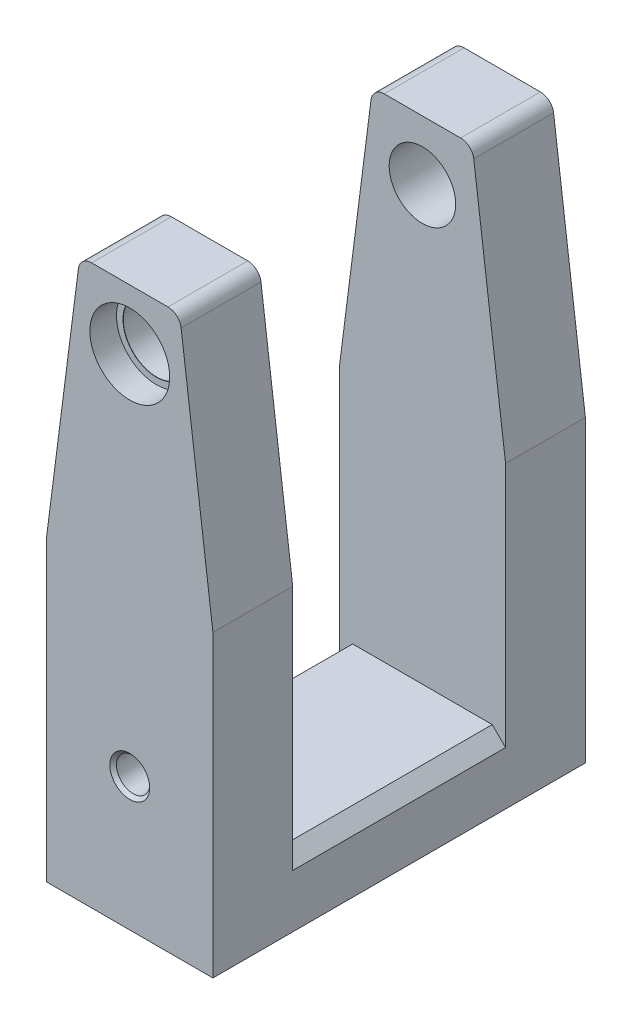
ISO-10303-21;
HEADER;
FILE_DESCRIPTION(('STEP AP214'),'2;1');
FILE_NAME('part.step','',(''),(''),'','','');
FILE_SCHEMA(('AUTOMOTIVE_DESIGN { 1 0 10303 214 1 1 1 1 }'));
ENDSEC;
DATA;
#1=APPLICATION_CONTEXT('core data for automotive mechanical design processes');
#2=APPLICATION_PROTOCOL_DEFINITION('international standard','automotive_design',2000,#1);
#3=PRODUCT_CONTEXT('',#1,'mechanical');
#4=PRODUCT('Part','Part','',(#3));
#5=PRODUCT_RELATED_PRODUCT_CATEGORY('part','',(#4));
#6=PRODUCT_DEFINITION_FORMATION('','',#4);
#7=PRODUCT_DEFINITION_CONTEXT('part definition',#1,'design');
#8=PRODUCT_DEFINITION('design','',#6,#7);
#9=PRODUCT_DEFINITION_SHAPE('','',#8);
#10=(LENGTH_UNIT() NAMED_UNIT(*) SI_UNIT(.MILLI.,.METRE.));
#11=(NAMED_UNIT(*) PLANE_ANGLE_UNIT() SI_UNIT($,.RADIAN.));
#12=(NAMED_UNIT(*) SI_UNIT($,.STERADIAN.) SOLID_ANGLE_UNIT());
#13=UNCERTAINTY_MEASURE_WITH_UNIT(LENGTH_MEASURE(1.E-05),#10,'distance_accuracy_value','');
#14=(GEOMETRIC_REPRESENTATION_CONTEXT(3) GLOBAL_UNCERTAINTY_ASSIGNED_CONTEXT((#13)) GLOBAL_UNIT_ASSIGNED_CONTEXT((#10,
#11,#12)) REPRESENTATION_CONTEXT('',''));
#15=CARTESIAN_POINT('',(0.,0.,0.));
#16=DIRECTION('',(0.,0.,1.));
#17=DIRECTION('',(1.,0.,0.));
#18=AXIS2_PLACEMENT_3D('',#15,#16,#17);
#19=CARTESIAN_POINT('',(7.5,84.,28.));
#20=DIRECTION('',(-0.991881664685851,-0.127164315985366,0.));
#21=DIRECTION('',(0.127164315985366,-0.991881664685851,0.));
#22=AXIS2_PLACEMENT_3D('',#19,#20,#21);
#23=PLANE('',#22);
#24=DIRECTION('',(-0.127164315985366,0.991881664685851,0.));
#25=VECTOR('',#24,1.);
#26=CARTESIAN_POINT('',(7.5,84.,16.));
#27=LINE('',#26,#25);
#28=CARTESIAN_POINT('',(12.5,45.,16.));
#29=VERTEX_POINT('',#28);
#30=CARTESIAN_POINT('',(7.72380402154221,82.2543286319707,16.));
#31=VERTEX_POINT('',#30);
#32=EDGE_CURVE('E345',#29,#31,#27,.T.);
#33=ORIENTED_EDGE('',*,*,#32,.T.);
#34=DIRECTION('',(0.,0.,-1.));
#35=VECTOR('',#34,1.);
#36=CARTESIAN_POINT('',(7.72380402154221,82.2543286319707,28.));
#37=LINE('',#36,#35);
#38=CARTESIAN_POINT('',(7.72380402154221,82.2543286319707,28.));
#39=VERTEX_POINT('',#38);
#40=EDGE_CURVE('E50',#31,#39,#37,.F.);
#41=ORIENTED_EDGE('',*,*,#40,.T.);
#42=DIRECTION('',(-0.127164315985366,0.99188166468585,0.));
#43=VECTOR('',#42,1.);
#44=CARTESIAN_POINT('',(7.5,84.,28.));
#45=LINE('',#44,#43);
#46=CARTESIAN_POINT('',(12.5,45.,28.));
#47=VERTEX_POINT('',#46);
#48=EDGE_CURVE('E352',#47,#39,#45,.T.);
#49=ORIENTED_EDGE('',*,*,#48,.F.);
#50=DIRECTION('',(0.,0.,-1.));
#51=VECTOR('',#50,1.);
#52=CARTESIAN_POINT('',(12.5,45.,28.));
#53=LINE('',#52,#51);
#54=EDGE_CURVE('E201',#47,#29,#53,.T.);
#55=ORIENTED_EDGE('',*,*,#54,.T.);
#56=EDGE_LOOP('',(#33,#41,#49,#55));
#57=FACE_BOUND('',#56,.T.);
#58=ADVANCED_FACE('F41',(#57),#23,.F.);
#59=CARTESIAN_POINT('',(-7.5,84.,28.));
#60=DIRECTION('',(0.,-1.,0.));
#61=DIRECTION('',(0.,0.,-1.));
#62=AXIS2_PLACEMENT_3D('',#59,#60,#61);
#63=PLANE('',#62);
#64=DIRECTION('',(1.,0.,0.));
#65=VECTOR('',#64,1.);
#66=CARTESIAN_POINT('',(-12.5,84.,16.));
#67=LINE('',#66,#65);
#68=CARTESIAN_POINT('',(-5.74004069217051,84.,16.));
#69=VERTEX_POINT('',#68);
#70=CARTESIAN_POINT('',(5.74004069217051,84.,16.));
#71=VERTEX_POINT('',#70);
#72=EDGE_CURVE('E321',#69,#71,#67,.T.);
#73=ORIENTED_EDGE('',*,*,#72,.F.);
#74=DIRECTION('',(0.,0.,-1.));
#75=VECTOR('',#74,1.);
#76=CARTESIAN_POINT('',(-5.74004069217051,84.,28.));
#77=LINE('',#76,#75);
#78=CARTESIAN_POINT('',(-5.74004069217051,84.,28.));
#79=VERTEX_POINT('',#78);
#80=EDGE_CURVE('E64',#69,#79,#77,.F.);
#81=ORIENTED_EDGE('',*,*,#80,.T.);
#82=DIRECTION('',(-1.,0.,0.));
#83=VECTOR('',#82,1.);
#84=CARTESIAN_POINT('',(-7.5,84.,28.));
#85=LINE('',#84,#83);
#86=CARTESIAN_POINT('',(5.74004069217051,84.,28.));
#87=VERTEX_POINT('',#86);
#88=EDGE_CURVE('E307',#87,#79,#85,.T.);
#89=ORIENTED_EDGE('',*,*,#88,.F.);
#90=DIRECTION('',(0.,0.,-1.));
#91=VECTOR('',#90,1.);
#92=CARTESIAN_POINT('',(5.74004069217051,84.,28.));
#93=LINE('',#92,#91);
#94=EDGE_CURVE('E289',#87,#71,#93,.T.);
#95=ORIENTED_EDGE('',*,*,#94,.T.);
#96=EDGE_LOOP('',(#73,#81,#89,#95));
#97=FACE_BOUND('',#96,.T.);
#98=ADVANCED_FACE('F323',(#97),#63,.F.);
#99=CARTESIAN_POINT('',(-12.5,45.,28.));
#100=DIRECTION('',(0.991881664685851,-0.127164315985366,0.));
#101=DIRECTION('',(0.127164315985366,0.991881664685851,0.));
#102=AXIS2_PLACEMENT_3D('',#99,#100,#101);
#103=PLANE('',#102);
#104=DIRECTION('',(-0.127164315985366,-0.99188166468585,0.));
#105=VECTOR('',#104,1.);
#106=CARTESIAN_POINT('',(-12.5,45.,28.));
#107=LINE('',#106,#105);
#108=CARTESIAN_POINT('',(-7.72380402154221,82.2543286319707,28.));
#109=VERTEX_POINT('',#108);
#110=CARTESIAN_POINT('',(-12.5,45.,28.));
#111=VERTEX_POINT('',#110);
#112=EDGE_CURVE('E305',#109,#111,#107,.T.);
#113=ORIENTED_EDGE('',*,*,#112,.F.);
#114=DIRECTION('',(0.,0.,-1.));
#115=VECTOR('',#114,1.);
#116=CARTESIAN_POINT('',(-7.72380402154221,82.2543286319707,28.));
#117=LINE('',#116,#115);
#118=CARTESIAN_POINT('',(-7.72380402154221,82.2543286319707,16.));
#119=VERTEX_POINT('',#118);
#120=EDGE_CURVE('E279',#109,#119,#117,.T.);
#121=ORIENTED_EDGE('',*,*,#120,.T.);
#122=DIRECTION('',(-0.127164315985366,-0.991881664685851,0.));
#123=VECTOR('',#122,1.);
#124=CARTESIAN_POINT('',(-12.5,45.,16.));
#125=LINE('',#124,#123);
#126=CARTESIAN_POINT('',(-12.5,45.,16.));
#127=VERTEX_POINT('',#126);
#128=EDGE_CURVE('E180',#119,#127,#125,.T.);
#129=ORIENTED_EDGE('',*,*,#128,.T.);
#130=DIRECTION('',(0.,0.,-1.));
#131=VECTOR('',#130,1.);
#132=CARTESIAN_POINT('',(-12.5,45.,28.));
#133=LINE('',#132,#131);
#134=EDGE_CURVE('E202',#111,#127,#133,.T.);
#135=ORIENTED_EDGE('',*,*,#134,.F.);
#136=EDGE_LOOP('',(#113,#121,#129,#135));
#137=FACE_BOUND('',#136,.T.);
#138=ADVANCED_FACE('F311',(#137),#103,.F.);
#139=CARTESIAN_POINT('',(12.5,45.,28.));
#140=DIRECTION('',(-1.,0.,0.));
#141=DIRECTION('',(0.,0.,1.));
#142=AXIS2_PLACEMENT_3D('',#139,#140,#141);
#143=PLANE('',#142);
#144=DIRECTION('',(0.,1.,0.));
#145=VECTOR('',#144,1.);
#146=CARTESIAN_POINT('',(12.5,84.,-16.));
#147=LINE('',#146,#145);
#148=CARTESIAN_POINT('',(12.5,8.,-16.));
#149=VERTEX_POINT('',#148);
#150=CARTESIAN_POINT('',(12.5,45.,-16.));
#151=VERTEX_POINT('',#150);
#152=EDGE_CURVE('E184',#149,#151,#147,.T.);
#153=ORIENTED_EDGE('',*,*,#152,.F.);
#154=DIRECTION('',(0.,0.,1.));
#155=VECTOR('',#154,1.);
#156=CARTESIAN_POINT('',(12.5,7.99999999999999,28.));
#157=LINE('',#156,#155);
#158=CARTESIAN_POINT('',(12.5,7.99999999999999,16.));
#159=VERTEX_POINT('',#158);
#160=EDGE_CURVE('E243',#149,#159,#157,.T.);
#161=ORIENTED_EDGE('',*,*,#160,.T.);
#162=DIRECTION('',(0.,-1.,0.));
#163=VECTOR('',#162,1.);
#164=CARTESIAN_POINT('',(12.5,84.,16.));
#165=LINE('',#164,#163);
#166=EDGE_CURVE('E193',#29,#159,#165,.T.);
#167=ORIENTED_EDGE('',*,*,#166,.F.);
#168=ORIENTED_EDGE('',*,*,#54,.F.);
#169=DIRECTION('',(0.,1.,0.));
#170=VECTOR('',#169,1.);
#171=CARTESIAN_POINT('',(12.5,45.,28.));
#172=LINE('',#171,#170);
#173=CARTESIAN_POINT('',(12.5,0.,28.));
#174=VERTEX_POINT('',#173);
#175=EDGE_CURVE('E348',#174,#47,#172,.T.);
#176=ORIENTED_EDGE('',*,*,#175,.F.);
#177=DIRECTION('',(0.,0.,-1.));
#178=VECTOR('',#177,1.);
#179=CARTESIAN_POINT('',(12.5,0.,28.));
#180=LINE('',#179,#178);
#181=CARTESIAN_POINT('',(12.5,0.,-28.));
#182=VERTEX_POINT('',#181);
#183=EDGE_CURVE('E363',#174,#182,#180,.T.);
#184=ORIENTED_EDGE('',*,*,#183,.T.);
#185=DIRECTION('',(0.,1.,0.));
#186=VECTOR('',#185,1.);
#187=CARTESIAN_POINT('',(12.5,45.,-28.));
#188=LINE('',#187,#186);
#189=CARTESIAN_POINT('',(12.5,45.,-28.));
#190=VERTEX_POINT('',#189);
#191=EDGE_CURVE('E199',#182,#190,#188,.T.);
#192=ORIENTED_EDGE('',*,*,#191,.T.);
#193=EDGE_CURVE('E173',#151,#190,#53,.T.);
#194=ORIENTED_EDGE('',*,*,#193,.F.);
#195=EDGE_LOOP('',(#153,#161,#167,#168,#176,#184,#192,#194));
#196=FACE_BOUND('',#195,.T.);
#197=ADVANCED_FACE('F196',(#196),#143,.F.);
#198=DIRECTION('',(-0.127164315985366,0.99188166468585,0.));
#199=VECTOR('',#198,1.);
#200=CARTESIAN_POINT('',(7.5,84.,-28.));
#201=LINE('',#200,#199);
#202=CARTESIAN_POINT('',(7.72380402154221,82.2543286319707,-28.));
#203=VERTEX_POINT('',#202);
#204=EDGE_CURVE('E366',#190,#203,#201,.T.);
#205=ORIENTED_EDGE('',*,*,#204,.T.);
#206=DIRECTION('',(0.,0.,-1.));
#207=VECTOR('',#206,1.);
#208=CARTESIAN_POINT('',(7.72380402154221,82.2543286319707,28.));
#209=LINE('',#208,#207);
#210=CARTESIAN_POINT('',(7.72380402154221,82.2543286319707,-16.));
#211=VERTEX_POINT('',#210);
#212=EDGE_CURVE('E176',#203,#211,#209,.F.);
#213=ORIENTED_EDGE('',*,*,#212,.T.);
#214=DIRECTION('',(0.127164315985366,-0.991881664685851,0.));
#215=VECTOR('',#214,1.);
#216=CARTESIAN_POINT('',(7.5,84.,-16.));
#217=LINE('',#216,#215);
#218=EDGE_CURVE('E168',#211,#151,#217,.T.);
#219=ORIENTED_EDGE('',*,*,#218,.T.);
#220=ORIENTED_EDGE('',*,*,#193,.T.);
#221=EDGE_LOOP('',(#205,#213,#219,#220));
#222=FACE_BOUND('',#221,.T.);
#223=ADVANCED_FACE('F171',(#222),#23,.F.);
#224=DIRECTION('',(1.,0.,0.));
#225=VECTOR('',#224,1.);
#226=CARTESIAN_POINT('',(-12.5,84.,-16.));
#227=LINE('',#226,#225);
#228=CARTESIAN_POINT('',(-5.74004069217051,84.,-16.));
#229=VERTEX_POINT('',#228);
#230=CARTESIAN_POINT('',(5.74004069217051,84.,-16.));
#231=VERTEX_POINT('',#230);
#232=EDGE_CURVE('E326',#229,#231,#227,.T.);
#233=ORIENTED_EDGE('',*,*,#232,.T.);
#234=DIRECTION('',(0.,0.,-1.));
#235=VECTOR('',#234,1.);
#236=CARTESIAN_POINT('',(5.74004069217051,84.,28.));
#237=LINE('',#236,#235);
#238=CARTESIAN_POINT('',(5.74004069217051,84.,-28.));
#239=VERTEX_POINT('',#238);
#240=EDGE_CURVE('E261',#231,#239,#237,.T.);
#241=ORIENTED_EDGE('',*,*,#240,.T.);
#242=DIRECTION('',(-1.,0.,0.));
#243=VECTOR('',#242,1.);
#244=CARTESIAN_POINT('',(-7.5,84.,-28.));
#245=LINE('',#244,#243);
#246=CARTESIAN_POINT('',(-5.74004069217051,84.,-28.));
#247=VERTEX_POINT('',#246);
#248=EDGE_CURVE('E369',#239,#247,#245,.T.);
#249=ORIENTED_EDGE('',*,*,#248,.T.);
#250=DIRECTION('',(0.,0.,-1.));
#251=VECTOR('',#250,1.);
#252=CARTESIAN_POINT('',(-5.74004069217051,84.,28.));
#253=LINE('',#252,#251);
#254=EDGE_CURVE('E258',#247,#229,#253,.F.);
#255=ORIENTED_EDGE('',*,*,#254,.T.);
#256=EDGE_LOOP('',(#233,#241,#249,#255));
#257=FACE_BOUND('',#256,.T.);
#258=ADVANCED_FACE('F438',(#257),#63,.F.);
#259=DIRECTION('',(0.127164315985366,0.991881664685851,0.));
#260=VECTOR('',#259,1.);
#261=CARTESIAN_POINT('',(-12.5,45.,-16.));
#262=LINE('',#261,#260);
#263=CARTESIAN_POINT('',(-12.5,45.,-16.));
#264=VERTEX_POINT('',#263);
#265=CARTESIAN_POINT('',(-7.72380402154221,82.2543286319707,-16.));
#266=VERTEX_POINT('',#265);
#267=EDGE_CURVE('E181',#264,#266,#262,.T.);
#268=ORIENTED_EDGE('',*,*,#267,.T.);
#269=DIRECTION('',(0.,0.,-1.));
#270=VECTOR('',#269,1.);
#271=CARTESIAN_POINT('',(-7.72380402154221,82.2543286319707,28.));
#272=LINE('',#271,#270);
#273=CARTESIAN_POINT('',(-7.72380402154221,82.2543286319707,-28.));
#274=VERTEX_POINT('',#273);
#275=EDGE_CURVE('E11',#266,#274,#272,.T.);
#276=ORIENTED_EDGE('',*,*,#275,.T.);
#277=DIRECTION('',(-0.127164315985366,-0.99188166468585,0.));
#278=VECTOR('',#277,1.);
#279=CARTESIAN_POINT('',(-12.5,45.,-28.));
#280=LINE('',#279,#278);
#281=CARTESIAN_POINT('',(-12.5,45.,-28.));
#282=VERTEX_POINT('',#281);
#283=EDGE_CURVE('E373',#274,#282,#280,.T.);
#284=ORIENTED_EDGE('',*,*,#283,.T.);
#285=EDGE_CURVE('E209',#264,#282,#133,.T.);
#286=ORIENTED_EDGE('',*,*,#285,.F.);
#287=EDGE_LOOP('',(#268,#276,#284,#286));
#288=FACE_BOUND('',#287,.T.);
#289=ADVANCED_FACE('F445',(#288),#103,.F.);
#290=CARTESIAN_POINT('',(-12.5,0.,28.));
#291=DIRECTION('',(1.,0.,0.));
#292=DIRECTION('',(0.,0.,-1.));
#293=AXIS2_PLACEMENT_3D('',#290,#291,#292);
#294=PLANE('',#293);
#295=DIRECTION('',(0.,0.,-1.));
#296=VECTOR('',#295,1.);
#297=CARTESIAN_POINT('',(-12.5,8.00000000000001,28.));
#298=LINE('',#297,#296);
#299=CARTESIAN_POINT('',(-12.5,8.00000000000001,16.));
#300=VERTEX_POINT('',#299);
#301=CARTESIAN_POINT('',(-12.5,8.00000000000001,-16.));
#302=VERTEX_POINT('',#301);
#303=EDGE_CURVE('E215',#300,#302,#298,.T.);
#304=ORIENTED_EDGE('',*,*,#303,.T.);
#305=DIRECTION('',(0.,1.,0.));
#306=VECTOR('',#305,1.);
#307=CARTESIAN_POINT('',(-12.5,84.,-16.));
#308=LINE('',#307,#306);
#309=EDGE_CURVE('E192',#302,#264,#308,.T.);
#310=ORIENTED_EDGE('',*,*,#309,.T.);
#311=ORIENTED_EDGE('',*,*,#285,.T.);
#312=DIRECTION('',(0.,-1.,0.));
#313=VECTOR('',#312,1.);
#314=CARTESIAN_POINT('',(-12.5,0.,-28.));
#315=LINE('',#314,#313);
#316=CARTESIAN_POINT('',(-12.5,0.,-28.));
#317=VERTEX_POINT('',#316);
#318=EDGE_CURVE('E376',#282,#317,#315,.T.);
#319=ORIENTED_EDGE('',*,*,#318,.T.);
#320=DIRECTION('',(0.,0.,-1.));
#321=VECTOR('',#320,1.);
#322=CARTESIAN_POINT('',(-12.5,0.,28.));
#323=LINE('',#322,#321);
#324=CARTESIAN_POINT('',(-12.5,0.,28.));
#325=VERTEX_POINT('',#324);
#326=EDGE_CURVE('E382',#325,#317,#323,.T.);
#327=ORIENTED_EDGE('',*,*,#326,.F.);
#328=DIRECTION('',(0.,-1.,0.));
#329=VECTOR('',#328,1.);
#330=CARTESIAN_POINT('',(-12.5,0.,28.));
#331=LINE('',#330,#329);
#332=EDGE_CURVE('E315',#111,#325,#331,.T.);
#333=ORIENTED_EDGE('',*,*,#332,.F.);
#334=ORIENTED_EDGE('',*,*,#134,.T.);
#335=DIRECTION('',(0.,-1.,0.));
#336=VECTOR('',#335,1.);
#337=CARTESIAN_POINT('',(-12.5,0.,16.));
#338=LINE('',#337,#336);
#339=EDGE_CURVE('E207',#127,#300,#338,.T.);
#340=ORIENTED_EDGE('',*,*,#339,.T.);
#341=EDGE_LOOP('',(#304,#310,#311,#319,#327,#333,#334,#340));
#342=FACE_BOUND('',#341,.T.);
#343=ADVANCED_FACE('F395',(#342),#294,.F.);
#344=CARTESIAN_POINT('',(12.5,0.,28.));
#345=DIRECTION('',(0.,1.,0.));
#346=DIRECTION('',(0.,0.,1.));
#347=AXIS2_PLACEMENT_3D('',#344,#345,#346);
#348=PLANE('',#347);
#349=DIRECTION('',(1.,0.,0.));
#350=VECTOR('',#349,1.);
#351=CARTESIAN_POINT('',(12.5,0.,-28.));
#352=LINE('',#351,#350);
#353=EDGE_CURVE('E353',#317,#182,#352,.T.);
#354=ORIENTED_EDGE('',*,*,#353,.T.);
#355=ORIENTED_EDGE('',*,*,#183,.F.);
#356=DIRECTION('',(1.,0.,0.));
#357=VECTOR('',#356,1.);
#358=CARTESIAN_POINT('',(12.5,0.,28.));
#359=LINE('',#358,#357);
#360=EDGE_CURVE('E360',#325,#174,#359,.T.);
#361=ORIENTED_EDGE('',*,*,#360,.F.);
#362=ORIENTED_EDGE('',*,*,#326,.T.);
#363=EDGE_LOOP('',(#354,#355,#361,#362));
#364=FACE_BOUND('',#363,.T.);
#365=ADVANCED_FACE('F402',(#364),#348,.F.);
#366=CARTESIAN_POINT('',(0.,0.,28.));
#367=DIRECTION('',(0.,0.,-1.));
#368=DIRECTION('',(-1.,0.,0.));
#369=AXIS2_PLACEMENT_3D('',#366,#367,#368);
#370=PLANE('',#369);
#371=CARTESIAN_POINT('',(0.,20.,28.));
#372=DIRECTION('',(0.,0.,1.));
#373=DIRECTION('',(1.,0.,0.));
#374=AXIS2_PLACEMENT_3D('',#371,#372,#373);
#375=CIRCLE('',#374,3.);
#376=CARTESIAN_POINT('',(3.,20.,28.));
#377=VERTEX_POINT('',#376);
#378=EDGE_CURVE('E533',#377,#377,#375,.T.);
#379=ORIENTED_EDGE('',*,*,#378,.F.);
#380=EDGE_LOOP('',(#379));
#381=FACE_BOUND('',#380,.T.);
#382=CARTESIAN_POINT('',(0.,75.,28.));
#383=DIRECTION('',(0.,0.,1.));
#384=DIRECTION('',(1.,0.,0.));
#385=AXIS2_PLACEMENT_3D('',#382,#383,#384);
#386=CIRCLE('',#385,5.99999999999999);
#387=CARTESIAN_POINT('',(6.,75.,28.));
#388=VERTEX_POINT('',#387);
#389=EDGE_CURVE('E225',#388,#388,#386,.T.);
#390=ORIENTED_EDGE('',*,*,#389,.F.);
#391=EDGE_LOOP('',(#390));
#392=FACE_BOUND('',#391,.T.);
#393=ORIENTED_EDGE('',*,*,#88,.T.);
#394=CARTESIAN_POINT('',(-5.74004069217051,82.,28.));
#395=DIRECTION('',(0.,0.,-1.));
#396=DIRECTION('',(-1.,0.,0.));
#397=AXIS2_PLACEMENT_3D('',#394,#395,#396);
#398=CIRCLE('',#397,2.);
#399=EDGE_CURVE('E298',#79,#109,#398,.F.);
#400=ORIENTED_EDGE('',*,*,#399,.T.);
#401=ORIENTED_EDGE('',*,*,#112,.T.);
#402=ORIENTED_EDGE('',*,*,#332,.T.);
#403=ORIENTED_EDGE('',*,*,#360,.T.);
#404=ORIENTED_EDGE('',*,*,#175,.T.);
#405=ORIENTED_EDGE('',*,*,#48,.T.);
#406=CARTESIAN_POINT('',(5.74004069217051,82.,28.));
#407=DIRECTION('',(0.,0.,-1.));
#408=DIRECTION('',(-1.,0.,0.));
#409=AXIS2_PLACEMENT_3D('',#406,#407,#408);
#410=CIRCLE('',#409,2.);
#411=EDGE_CURVE('E295',#39,#87,#410,.F.);
#412=ORIENTED_EDGE('',*,*,#411,.T.);
#413=EDGE_LOOP('',(#393,#400,#401,#402,#403,#404,#405,#412));
#414=FACE_BOUND('',#413,.T.);
#415=ADVANCED_FACE('F304',(#381,#392,#414),#370,.F.);
#416=CARTESIAN_POINT('',(0.,0.,-28.));
#417=DIRECTION('',(0.,0.,-1.));
#418=DIRECTION('',(-1.,0.,0.));
#419=AXIS2_PLACEMENT_3D('',#416,#417,#418);
#420=PLANE('',#419);
#421=CARTESIAN_POINT('',(0.,75.,-28.));
#422=DIRECTION('',(0.,0.,-1.));
#423=DIRECTION('',(-1.,0.,0.));
#424=AXIS2_PLACEMENT_3D('',#421,#422,#423);
#425=CIRCLE('',#424,5.99999999999999);
#426=CARTESIAN_POINT('',(-5.99999999999999,75.,-28.));
#427=VERTEX_POINT('',#426);
#428=EDGE_CURVE('E231',#427,#427,#425,.T.);
#429=ORIENTED_EDGE('',*,*,#428,.F.);
#430=EDGE_LOOP('',(#429));
#431=FACE_BOUND('',#430,.T.);
#432=ORIENTED_EDGE('',*,*,#248,.F.);
#433=CARTESIAN_POINT('',(5.74004069217051,82.,-28.));
#434=DIRECTION('',(0.,0.,-1.));
#435=DIRECTION('',(-1.,0.,0.));
#436=AXIS2_PLACEMENT_3D('',#433,#434,#435);
#437=CIRCLE('',#436,2.);
#438=EDGE_CURVE('E268',#239,#203,#437,.T.);
#439=ORIENTED_EDGE('',*,*,#438,.T.);
#440=ORIENTED_EDGE('',*,*,#204,.F.);
#441=ORIENTED_EDGE('',*,*,#191,.F.);
#442=ORIENTED_EDGE('',*,*,#353,.F.);
#443=ORIENTED_EDGE('',*,*,#318,.F.);
#444=ORIENTED_EDGE('',*,*,#283,.F.);
#445=CARTESIAN_POINT('',(-5.74004069217051,82.,-28.));
#446=DIRECTION('',(0.,0.,-1.));
#447=DIRECTION('',(-1.,0.,0.));
#448=AXIS2_PLACEMENT_3D('',#445,#446,#447);
#449=CIRCLE('',#448,2.);
#450=EDGE_CURVE('E265',#274,#247,#449,.T.);
#451=ORIENTED_EDGE('',*,*,#450,.T.);
#452=EDGE_LOOP('',(#432,#439,#440,#441,#442,#443,#444,#451));
#453=FACE_BOUND('',#452,.T.);
#454=ADVANCED_FACE('F400',(#431,#453),#420,.T.);
#455=CARTESIAN_POINT('',(-12.5,84.,16.));
#456=DIRECTION('',(0.,0.,1.));
#457=DIRECTION('',(0.,-1.,0.));
#458=AXIS2_PLACEMENT_3D('',#455,#456,#457);
#459=PLANE('',#458);
#460=CARTESIAN_POINT('',(0.,20.,16.));
#461=DIRECTION('',(0.,0.,1.));
#462=DIRECTION('',(0.,-1.,0.));
#463=AXIS2_PLACEMENT_3D('',#460,#461,#462);
#464=CIRCLE('',#463,2.5);
#465=CARTESIAN_POINT('',(0.,17.5,16.));
#466=VERTEX_POINT('',#465);
#467=EDGE_CURVE('E227',#466,#466,#464,.T.);
#468=ORIENTED_EDGE('',*,*,#467,.T.);
#469=EDGE_LOOP('',(#468));
#470=FACE_BOUND('',#469,.T.);
#471=CARTESIAN_POINT('',(0.,75.,16.));
#472=DIRECTION('',(0.,0.,1.));
#473=DIRECTION('',(0.,-1.,0.));
#474=AXIS2_PLACEMENT_3D('',#471,#472,#473);
#475=CIRCLE('',#474,5.);
#476=CARTESIAN_POINT('',(0.,70.,16.));
#477=VERTEX_POINT('',#476);
#478=EDGE_CURVE('E216',#477,#477,#475,.T.);
#479=ORIENTED_EDGE('',*,*,#478,.T.);
#480=EDGE_LOOP('',(#479));
#481=FACE_BOUND('',#480,.T.);
#482=ORIENTED_EDGE('',*,*,#128,.F.);
#483=CARTESIAN_POINT('',(-5.74004069217051,82.,16.));
#484=DIRECTION('',(0.,0.,1.));
#485=DIRECTION('',(0.,-1.,0.));
#486=AXIS2_PLACEMENT_3D('',#483,#484,#485);
#487=CIRCLE('',#486,2.);
#488=EDGE_CURVE('E286',#119,#69,#487,.F.);
#489=ORIENTED_EDGE('',*,*,#488,.T.);
#490=ORIENTED_EDGE('',*,*,#72,.T.);
#491=CARTESIAN_POINT('',(5.74004069217051,82.,16.));
#492=DIRECTION('',(0.,0.,1.));
#493=DIRECTION('',(0.,-1.,0.));
#494=AXIS2_PLACEMENT_3D('',#491,#492,#493);
#495=CIRCLE('',#494,2.);
#496=EDGE_CURVE('E283',#71,#31,#495,.F.);
#497=ORIENTED_EDGE('',*,*,#496,.T.);
#498=ORIENTED_EDGE('',*,*,#32,.F.);
#499=ORIENTED_EDGE('',*,*,#166,.T.);
#500=DIRECTION('',(0.707106781186545,-0.70710678118655,0.));
#501=VECTOR('',#500,1.);
#502=CARTESIAN_POINT('',(-37.9999999999999,58.5000000000003,16.));
#503=LINE('',#502,#501);
#504=CARTESIAN_POINT('',(10.5,9.99999999999999,16.));
#505=VERTEX_POINT('',#504);
#506=EDGE_CURVE('E255',#159,#505,#503,.F.);
#507=ORIENTED_EDGE('',*,*,#506,.T.);
#508=DIRECTION('',(1.,0.,0.));
#509=VECTOR('',#508,1.);
#510=CARTESIAN_POINT('',(-12.5,9.99999999999999,16.));
#511=LINE('',#510,#509);
#512=CARTESIAN_POINT('',(-10.5,9.99999999999999,16.));
#513=VERTEX_POINT('',#512);
#514=EDGE_CURVE('E339',#513,#505,#511,.T.);
#515=ORIENTED_EDGE('',*,*,#514,.F.);
#516=DIRECTION('',(0.70710678118655,0.707106781186545,0.));
#517=VECTOR('',#516,1.);
#518=CARTESIAN_POINT('',(25.5,45.9999999999998,16.));
#519=LINE('',#518,#517);
#520=EDGE_CURVE('E249',#513,#300,#519,.F.);
#521=ORIENTED_EDGE('',*,*,#520,.T.);
#522=ORIENTED_EDGE('',*,*,#339,.F.);
#523=EDGE_LOOP('',(#482,#489,#490,#497,#498,#499,#507,#515,#521,#522));
#524=FACE_BOUND('',#523,.T.);
#525=ADVANCED_FACE('F320',(#470,#481,#524),#459,.F.);
#526=CARTESIAN_POINT('',(-12.5,84.,-16.));
#527=DIRECTION('',(0.,0.,-1.));
#528=DIRECTION('',(0.,1.,0.));
#529=AXIS2_PLACEMENT_3D('',#526,#527,#528);
#530=PLANE('',#529);
#531=CARTESIAN_POINT('',(0.,75.,-16.));
#532=DIRECTION('',(0.,0.,-1.));
#533=DIRECTION('',(0.,1.,0.));
#534=AXIS2_PLACEMENT_3D('',#531,#532,#533);
#535=CIRCLE('',#534,5.);
#536=CARTESIAN_POINT('',(0.,80.,-16.));
#537=VERTEX_POINT('',#536);
#538=EDGE_CURVE('E221',#537,#537,#535,.T.);
#539=ORIENTED_EDGE('',*,*,#538,.T.);
#540=EDGE_LOOP('',(#539));
#541=FACE_BOUND('',#540,.T.);
#542=ORIENTED_EDGE('',*,*,#218,.F.);
#543=CARTESIAN_POINT('',(5.74004069217051,82.,-16.));
#544=DIRECTION('',(0.,0.,-1.));
#545=DIRECTION('',(0.,1.,0.));
#546=AXIS2_PLACEMENT_3D('',#543,#544,#545);
#547=CIRCLE('',#546,2.);
#548=EDGE_CURVE('E276',#211,#231,#547,.F.);
#549=ORIENTED_EDGE('',*,*,#548,.T.);
#550=ORIENTED_EDGE('',*,*,#232,.F.);
#551=CARTESIAN_POINT('',(-5.74004069217051,82.,-16.));
#552=DIRECTION('',(0.,0.,-1.));
#553=DIRECTION('',(0.,1.,0.));
#554=AXIS2_PLACEMENT_3D('',#551,#552,#553);
#555=CIRCLE('',#554,2.);
#556=EDGE_CURVE('E273',#229,#266,#555,.F.);
#557=ORIENTED_EDGE('',*,*,#556,.T.);
#558=ORIENTED_EDGE('',*,*,#267,.F.);
#559=ORIENTED_EDGE('',*,*,#309,.F.);
#560=DIRECTION('',(-0.70710678118655,-0.707106781186545,0.));
#561=VECTOR('',#560,1.);
#562=CARTESIAN_POINT('',(25.5,45.9999999999998,-16.));
#563=LINE('',#562,#561);
#564=CARTESIAN_POINT('',(-10.5,10.,-16.));
#565=VERTEX_POINT('',#564);
#566=EDGE_CURVE('E246',#302,#565,#563,.F.);
#567=ORIENTED_EDGE('',*,*,#566,.T.);
#568=DIRECTION('',(1.,0.,0.));
#569=VECTOR('',#568,1.);
#570=CARTESIAN_POINT('',(-12.5,10.,-16.));
#571=LINE('',#570,#569);
#572=CARTESIAN_POINT('',(10.5,10.,-16.));
#573=VERTEX_POINT('',#572);
#574=EDGE_CURVE('E333',#565,#573,#571,.T.);
#575=ORIENTED_EDGE('',*,*,#574,.T.);
#576=DIRECTION('',(-0.707106781186545,0.70710678118655,0.));
#577=VECTOR('',#576,1.);
#578=CARTESIAN_POINT('',(-37.9999999999999,58.5000000000003,-16.));
#579=LINE('',#578,#577);
#580=EDGE_CURVE('E187',#573,#149,#579,.F.);
#581=ORIENTED_EDGE('',*,*,#580,.T.);
#582=ORIENTED_EDGE('',*,*,#152,.T.);
#583=EDGE_LOOP('',(#542,#549,#550,#557,#558,#559,#567,#575,#581,#582));
#584=FACE_BOUND('',#583,.T.);
#585=ADVANCED_FACE('F185',(#541,#584),#530,.F.);
#586=CARTESIAN_POINT('',(-12.5,9.99999999999999,16.));
#587=DIRECTION('',(0.,-1.,0.));
#588=DIRECTION('',(0.,0.,-1.));
#589=AXIS2_PLACEMENT_3D('',#586,#587,#588);
#590=PLANE('',#589);
#591=ORIENTED_EDGE('',*,*,#574,.F.);
#592=DIRECTION('',(0.,0.,1.));
#593=VECTOR('',#592,1.);
#594=CARTESIAN_POINT('',(-10.5,9.99999999999999,16.));
#595=LINE('',#594,#593);
#596=EDGE_CURVE('E240',#565,#513,#595,.T.);
#597=ORIENTED_EDGE('',*,*,#596,.T.);
#598=ORIENTED_EDGE('',*,*,#514,.T.);
#599=DIRECTION('',(0.,0.,-1.));
#600=VECTOR('',#599,1.);
#601=CARTESIAN_POINT('',(10.5,9.99999999999999,16.));
#602=LINE('',#601,#600);
#603=EDGE_CURVE('E236',#505,#573,#602,.T.);
#604=ORIENTED_EDGE('',*,*,#603,.T.);
#605=EDGE_LOOP('',(#591,#597,#598,#604));
#606=FACE_BOUND('',#605,.T.);
#607=ADVANCED_FACE('F416',(#606),#590,.F.);
#608=CARTESIAN_POINT('',(0.,75.,28.));
#609=DIRECTION('',(0.,0.,1.));
#610=DIRECTION('',(1.,0.,0.));
#611=AXIS2_PLACEMENT_3D('',#608,#609,#610);
#612=CYLINDRICAL_SURFACE('',#611,5.);
#613=CARTESIAN_POINT('',(0.,75.,23.975));
#614=DIRECTION('',(0.,0.,1.));
#615=DIRECTION('',(1.,0.,0.));
#616=AXIS2_PLACEMENT_3D('',#613,#614,#615);
#617=CIRCLE('',#616,5.);
#618=CARTESIAN_POINT('',(5.,75.,23.975));
#619=VERTEX_POINT('',#618);
#620=EDGE_CURVE('E220',#619,#619,#617,.T.);
#621=ORIENTED_EDGE('',*,*,#620,.T.);
#622=EDGE_LOOP('',(#621));
#623=FACE_BOUND('',#622,.T.);
#624=ORIENTED_EDGE('',*,*,#478,.F.);
#625=EDGE_LOOP('',(#624));
#626=FACE_BOUND('',#625,.T.);
#627=ADVANCED_FACE('F485',(#623,#626),#612,.F.);
#628=CARTESIAN_POINT('',(0.,75.,24.));
#629=DIRECTION('',(0.,0.,1.));
#630=DIRECTION('',(1.,0.,0.));
#631=AXIS2_PLACEMENT_3D('',#628,#629,#630);
#632=CONICAL_SURFACE('',#631,5.025,0.785398163397258);
#633=ORIENTED_EDGE('',*,*,#620,.F.);
#634=EDGE_LOOP('',(#633));
#635=FACE_BOUND('',#634,.T.);
#636=CARTESIAN_POINT('',(0.,75.,24.));
#637=DIRECTION('',(0.,0.,1.));
#638=DIRECTION('',(1.,0.,0.));
#639=AXIS2_PLACEMENT_3D('',#636,#637,#638);
#640=CIRCLE('',#639,5.025);
#641=CARTESIAN_POINT('',(5.025,75.,24.));
#642=VERTEX_POINT('',#641);
#643=EDGE_CURVE('E560',#642,#642,#640,.T.);
#644=ORIENTED_EDGE('',*,*,#643,.T.);
#645=EDGE_LOOP('',(#644));
#646=FACE_BOUND('',#645,.T.);
#647=ADVANCED_FACE('F491',(#635,#646),#632,.F.);
#648=CARTESIAN_POINT('',(5.025,75.,24.));
#649=DIRECTION('',(0.,0.,-1.));
#650=DIRECTION('',(-1.,0.,0.));
#651=AXIS2_PLACEMENT_3D('',#648,#649,#650);
#652=PLANE('',#651);
#653=ORIENTED_EDGE('',*,*,#643,.F.);
#654=EDGE_LOOP('',(#653));
#655=FACE_BOUND('',#654,.T.);
#656=CARTESIAN_POINT('',(0.,75.,24.));
#657=DIRECTION('',(0.,0.,1.));
#658=DIRECTION('',(1.,0.,0.));
#659=AXIS2_PLACEMENT_3D('',#656,#657,#658);
#660=CIRCLE('',#659,6.);
#661=CARTESIAN_POINT('',(6.,75.,24.));
#662=VERTEX_POINT('',#661);
#663=EDGE_CURVE('E556',#662,#662,#660,.T.);
#664=ORIENTED_EDGE('',*,*,#663,.T.);
#665=EDGE_LOOP('',(#664));
#666=FACE_BOUND('',#665,.T.);
#667=ADVANCED_FACE('F495',(#655,#666),#652,.F.);
#668=CARTESIAN_POINT('',(0.,75.,28.));
#669=DIRECTION('',(0.,0.,1.));
#670=DIRECTION('',(1.,0.,0.));
#671=AXIS2_PLACEMENT_3D('',#668,#669,#670);
#672=CYLINDRICAL_SURFACE('',#671,6.);
#673=ORIENTED_EDGE('',*,*,#663,.F.);
#674=EDGE_LOOP('',(#673));
#675=FACE_BOUND('',#674,.T.);
#676=ORIENTED_EDGE('',*,*,#389,.T.);
#677=EDGE_LOOP('',(#676));
#678=FACE_BOUND('',#677,.T.);
#679=ADVANCED_FACE('F499',(#675,#678),#672,.F.);
#680=CARTESIAN_POINT('',(0.,75.,-28.));
#681=DIRECTION('',(0.,0.,-1.));
#682=DIRECTION('',(-1.,0.,0.));
#683=AXIS2_PLACEMENT_3D('',#680,#681,#682);
#684=CYLINDRICAL_SURFACE('',#683,5.);
#685=CARTESIAN_POINT('',(0.,75.,-23.975));
#686=DIRECTION('',(0.,0.,-1.));
#687=DIRECTION('',(-1.,0.,0.));
#688=AXIS2_PLACEMENT_3D('',#685,#686,#687);
#689=CIRCLE('',#688,5.);
#690=CARTESIAN_POINT('',(-5.,75.,-23.975));
#691=VERTEX_POINT('',#690);
#692=EDGE_CURVE('E226',#691,#691,#689,.T.);
#693=ORIENTED_EDGE('',*,*,#692,.T.);
#694=EDGE_LOOP('',(#693));
#695=FACE_BOUND('',#694,.T.);
#696=ORIENTED_EDGE('',*,*,#538,.F.);
#697=EDGE_LOOP('',(#696));
#698=FACE_BOUND('',#697,.T.);
#699=ADVANCED_FACE('F503',(#695,#698),#684,.F.);
#700=CARTESIAN_POINT('',(0.,75.,-24.));
#701=DIRECTION('',(0.,0.,-1.));
#702=DIRECTION('',(-1.,0.,0.));
#703=AXIS2_PLACEMENT_3D('',#700,#701,#702);
#704=CONICAL_SURFACE('',#703,5.025,0.785398163397258);
#705=ORIENTED_EDGE('',*,*,#692,.F.);
#706=EDGE_LOOP('',(#705));
#707=FACE_BOUND('',#706,.T.);
#708=CARTESIAN_POINT('',(0.,75.,-24.));
#709=DIRECTION('',(0.,0.,-1.));
#710=DIRECTION('',(-1.,0.,0.));
#711=AXIS2_PLACEMENT_3D('',#708,#709,#710);
#712=CIRCLE('',#711,5.025);
#713=CARTESIAN_POINT('',(-5.025,75.,-24.));
#714=VERTEX_POINT('',#713);
#715=EDGE_CURVE('E546',#714,#714,#712,.T.);
#716=ORIENTED_EDGE('',*,*,#715,.T.);
#717=EDGE_LOOP('',(#716));
#718=FACE_BOUND('',#717,.T.);
#719=ADVANCED_FACE('F507',(#707,#718),#704,.F.);
#720=CARTESIAN_POINT('',(5.025,75.,-24.));
#721=DIRECTION('',(0.,0.,1.));
#722=DIRECTION('',(1.,0.,0.));
#723=AXIS2_PLACEMENT_3D('',#720,#721,#722);
#724=PLANE('',#723);
#725=ORIENTED_EDGE('',*,*,#715,.F.);
#726=EDGE_LOOP('',(#725));
#727=FACE_BOUND('',#726,.T.);
#728=CARTESIAN_POINT('',(0.,75.,-24.));
#729=DIRECTION('',(0.,0.,-1.));
#730=DIRECTION('',(-1.,0.,0.));
#731=AXIS2_PLACEMENT_3D('',#728,#729,#730);
#732=CIRCLE('',#731,6.);
#733=CARTESIAN_POINT('',(-6.,75.,-24.));
#734=VERTEX_POINT('',#733);
#735=EDGE_CURVE('E542',#734,#734,#732,.T.);
#736=ORIENTED_EDGE('',*,*,#735,.T.);
#737=EDGE_LOOP('',(#736));
#738=FACE_BOUND('',#737,.T.);
#739=ADVANCED_FACE('F511',(#727,#738),#724,.F.);
#740=CARTESIAN_POINT('',(0.,75.,-28.));
#741=DIRECTION('',(0.,0.,-1.));
#742=DIRECTION('',(-1.,0.,0.));
#743=AXIS2_PLACEMENT_3D('',#740,#741,#742);
#744=CYLINDRICAL_SURFACE('',#743,6.);
#745=ORIENTED_EDGE('',*,*,#735,.F.);
#746=EDGE_LOOP('',(#745));
#747=FACE_BOUND('',#746,.T.);
#748=ORIENTED_EDGE('',*,*,#428,.T.);
#749=EDGE_LOOP('',(#748));
#750=FACE_BOUND('',#749,.T.);
#751=ADVANCED_FACE('F515',(#747,#750),#744,.F.);
#752=CARTESIAN_POINT('',(0.,20.,28.));
#753=DIRECTION('',(0.,0.,1.));
#754=DIRECTION('',(1.,0.,0.));
#755=AXIS2_PLACEMENT_3D('',#752,#753,#754);
#756=CYLINDRICAL_SURFACE('',#755,2.5);
#757=CARTESIAN_POINT('',(0.,20.,27.5));
#758=DIRECTION('',(0.,0.,1.));
#759=DIRECTION('',(1.,0.,0.));
#760=AXIS2_PLACEMENT_3D('',#757,#758,#759);
#761=CIRCLE('',#760,2.5);
#762=CARTESIAN_POINT('',(2.5,20.,27.5));
#763=VERTEX_POINT('',#762);
#764=EDGE_CURVE('E232',#763,#763,#761,.T.);
#765=ORIENTED_EDGE('',*,*,#764,.T.);
#766=EDGE_LOOP('',(#765));
#767=FACE_BOUND('',#766,.T.);
#768=ORIENTED_EDGE('',*,*,#467,.F.);
#769=EDGE_LOOP('',(#768));
#770=FACE_BOUND('',#769,.T.);
#771=ADVANCED_FACE('F519',(#767,#770),#756,.F.);
#772=CARTESIAN_POINT('',(0.,20.,28.));
#773=DIRECTION('',(0.,0.,1.));
#774=DIRECTION('',(1.,0.,0.));
#775=AXIS2_PLACEMENT_3D('',#772,#773,#774);
#776=CONICAL_SURFACE('',#775,3.,0.785398163397445);
#777=ORIENTED_EDGE('',*,*,#764,.F.);
#778=EDGE_LOOP('',(#777));
#779=FACE_BOUND('',#778,.T.);
#780=ORIENTED_EDGE('',*,*,#378,.T.);
#781=EDGE_LOOP('',(#780));
#782=FACE_BOUND('',#781,.T.);
#783=ADVANCED_FACE('F454',(#779,#782),#776,.F.);
#784=CARTESIAN_POINT('',(-12.5,8.00000000000001,28.));
#785=DIRECTION('',(0.707106781186545,-0.70710678118655,0.));
#786=DIRECTION('',(0.,0.,-1.));
#787=AXIS2_PLACEMENT_3D('',#784,#785,#786);
#788=PLANE('',#787);
#789=ORIENTED_EDGE('',*,*,#520,.F.);
#790=ORIENTED_EDGE('',*,*,#596,.F.);
#791=ORIENTED_EDGE('',*,*,#566,.F.);
#792=ORIENTED_EDGE('',*,*,#303,.F.);
#793=EDGE_LOOP('',(#789,#790,#791,#792));
#794=FACE_BOUND('',#793,.T.);
#795=ADVANCED_FACE('F413',(#794),#788,.F.);
#796=CARTESIAN_POINT('',(10.5,9.99999999999999,16.));
#797=DIRECTION('',(-0.70710678118655,-0.707106781186545,0.));
#798=DIRECTION('',(0.,0.,-1.));
#799=AXIS2_PLACEMENT_3D('',#796,#797,#798);
#800=PLANE('',#799);
#801=ORIENTED_EDGE('',*,*,#506,.F.);
#802=ORIENTED_EDGE('',*,*,#160,.F.);
#803=ORIENTED_EDGE('',*,*,#580,.F.);
#804=ORIENTED_EDGE('',*,*,#603,.F.);
#805=EDGE_LOOP('',(#801,#802,#803,#804));
#806=FACE_BOUND('',#805,.T.);
#807=ADVANCED_FACE('F420',(#806),#800,.F.);
#808=CARTESIAN_POINT('',(5.74004069217051,82.,28.));
#809=DIRECTION('',(0.,0.,-1.));
#810=DIRECTION('',(-1.,0.,0.));
#811=AXIS2_PLACEMENT_3D('',#808,#809,#810);
#812=CYLINDRICAL_SURFACE('',#811,2.);
#813=ORIENTED_EDGE('',*,*,#548,.F.);
#814=ORIENTED_EDGE('',*,*,#212,.F.);
#815=ORIENTED_EDGE('',*,*,#438,.F.);
#816=ORIENTED_EDGE('',*,*,#240,.F.);
#817=EDGE_LOOP('',(#813,#814,#815,#816));
#818=FACE_BOUND('',#817,.T.);
#819=ADVANCED_FACE('F430',(#818),#812,.T.);
#820=CARTESIAN_POINT('',(-5.74004069217051,82.,28.));
#821=DIRECTION('',(0.,0.,-1.));
#822=DIRECTION('',(-1.,0.,0.));
#823=AXIS2_PLACEMENT_3D('',#820,#821,#822);
#824=CYLINDRICAL_SURFACE('',#823,2.);
#825=ORIENTED_EDGE('',*,*,#399,.F.);
#826=ORIENTED_EDGE('',*,*,#80,.F.);
#827=ORIENTED_EDGE('',*,*,#488,.F.);
#828=ORIENTED_EDGE('',*,*,#120,.F.);
#829=EDGE_LOOP('',(#825,#826,#827,#828));
#830=FACE_BOUND('',#829,.T.);
#831=ADVANCED_FACE('F317',(#830),#824,.T.);
#832=CARTESIAN_POINT('',(5.74004069217051,82.,28.));
#833=DIRECTION('',(0.,0.,-1.));
#834=DIRECTION('',(-1.,0.,0.));
#835=AXIS2_PLACEMENT_3D('',#832,#833,#834);
#836=CYLINDRICAL_SURFACE('',#835,2.);
#837=ORIENTED_EDGE('',*,*,#411,.F.);
#838=ORIENTED_EDGE('',*,*,#40,.F.);
#839=ORIENTED_EDGE('',*,*,#496,.F.);
#840=ORIENTED_EDGE('',*,*,#94,.F.);
#841=EDGE_LOOP('',(#837,#838,#839,#840));
#842=FACE_BOUND('',#841,.T.);
#843=ADVANCED_FACE('F423',(#842),#836,.T.);
#844=CARTESIAN_POINT('',(-5.74004069217051,82.,28.));
#845=DIRECTION('',(0.,0.,-1.));
#846=DIRECTION('',(-1.,0.,0.));
#847=AXIS2_PLACEMENT_3D('',#844,#845,#846);
#848=CYLINDRICAL_SURFACE('',#847,2.);
#849=ORIENTED_EDGE('',*,*,#556,.F.);
#850=ORIENTED_EDGE('',*,*,#254,.F.);
#851=ORIENTED_EDGE('',*,*,#450,.F.);
#852=ORIENTED_EDGE('',*,*,#275,.F.);
#853=EDGE_LOOP('',(#849,#850,#851,#852));
#854=FACE_BOUND('',#853,.T.);
#855=ADVANCED_FACE('F43',(#854),#848,.T.);
#856=CLOSED_SHELL('',(#58,#98,#138,#197,#223,#258,#289,#343,#365,#415,#454,#525,#585,#607,#627,
#647,#667,#679,#699,#719,#739,#751,#771,#783,#795,#807,#819,#831,#843,#855));
#857=MANIFOLD_SOLID_BREP('B2',#856);
#858=ADVANCED_BREP_SHAPE_REPRESENTATION('',(#18,#857),#14);
#859=SHAPE_DEFINITION_REPRESENTATION(#9,#858);
ENDSEC;
END-ISO-10303-21;
